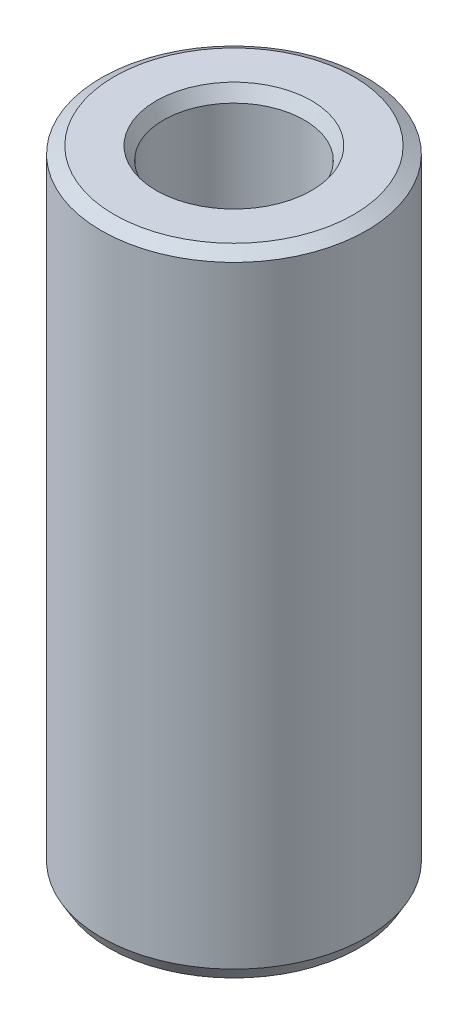
ISO-10303-21;
HEADER;
FILE_DESCRIPTION(('STEP AP214'),'2;1');
FILE_NAME('part.step','',(''),(''),'','','');
FILE_SCHEMA(('AUTOMOTIVE_DESIGN { 1 0 10303 214 1 1 1 1 }'));
ENDSEC;
DATA;
#1=APPLICATION_CONTEXT('core data for automotive mechanical design processes');
#2=APPLICATION_PROTOCOL_DEFINITION('international standard','automotive_design',2000,#1);
#3=PRODUCT_CONTEXT('',#1,'mechanical');
#4=PRODUCT('Part','Part','',(#3));
#5=PRODUCT_RELATED_PRODUCT_CATEGORY('part','',(#4));
#6=PRODUCT_DEFINITION_FORMATION('','',#4);
#7=PRODUCT_DEFINITION_CONTEXT('part definition',#1,'design');
#8=PRODUCT_DEFINITION('design','',#6,#7);
#9=PRODUCT_DEFINITION_SHAPE('','',#8);
#10=(LENGTH_UNIT() NAMED_UNIT(*) SI_UNIT(.MILLI.,.METRE.));
#11=(NAMED_UNIT(*) PLANE_ANGLE_UNIT() SI_UNIT($,.RADIAN.));
#12=(NAMED_UNIT(*) SI_UNIT($,.STERADIAN.) SOLID_ANGLE_UNIT());
#13=UNCERTAINTY_MEASURE_WITH_UNIT(LENGTH_MEASURE(1.E-05),#10,'distance_accuracy_value','');
#14=(GEOMETRIC_REPRESENTATION_CONTEXT(3) GLOBAL_UNCERTAINTY_ASSIGNED_CONTEXT((#13)) GLOBAL_UNIT_ASSIGNED_CONTEXT((#10,
#11,#12)) REPRESENTATION_CONTEXT('',''));
#15=CARTESIAN_POINT('',(0.,0.,0.));
#16=DIRECTION('',(0.,0.,1.));
#17=DIRECTION('',(1.,0.,0.));
#18=AXIS2_PLACEMENT_3D('',#15,#16,#17);
#19=CARTESIAN_POINT('',(0.,167.013474711773,0.));
#20=DIRECTION('',(0.,-1.,0.));
#21=DIRECTION('',(0.,0.,-1.));
#22=AXIS2_PLACEMENT_3D('',#19,#20,#21);
#23=CYLINDRICAL_SURFACE('',#22,35.);
#24=CARTESIAN_POINT('',(0.,3.4060776990138,0.));
#25=DIRECTION('',(0.,1.,0.));
#26=DIRECTION('',(0.,0.,1.));
#27=AXIS2_PLACEMENT_3D('',#24,#25,#26);
#28=CIRCLE('',#27,35.);
#29=CARTESIAN_POINT('',(0.,3.4060776990138,35.));
#30=VERTEX_POINT('',#29);
#31=EDGE_CURVE('E10',#30,#30,#28,.T.);
#32=ORIENTED_EDGE('',*,*,#31,.T.);
#33=EDGE_LOOP('',(#32));
#34=FACE_BOUND('',#33,.T.);
#35=CARTESIAN_POINT('',(0.,165.046974835367,0.));
#36=DIRECTION('',(0.,1.,0.));
#37=DIRECTION('',(0.,0.,1.));
#38=AXIS2_PLACEMENT_3D('',#35,#36,#37);
#39=CIRCLE('',#38,35.);
#40=CARTESIAN_POINT('',(0.,165.046974835367,35.));
#41=VERTEX_POINT('',#40);
#42=EDGE_CURVE('E50',#41,#41,#39,.F.);
#43=ORIENTED_EDGE('',*,*,#42,.T.);
#44=EDGE_LOOP('',(#43));
#45=FACE_BOUND('',#44,.T.);
#46=ADVANCED_FACE('F39',(#34,#45),#23,.T.);
#47=CARTESIAN_POINT('',(0.,167.013474711773,0.));
#48=DIRECTION('',(0.,1.,0.));
#49=DIRECTION('',(0.,0.,1.));
#50=AXIS2_PLACEMENT_3D('',#47,#48,#49);
#51=PLANE('',#50);
#52=CARTESIAN_POINT('',(0.,167.013474711773,0.));
#53=DIRECTION('',(0.,1.,0.));
#54=DIRECTION('',(0.,0.,1.));
#55=AXIS2_PLACEMENT_3D('',#52,#53,#54);
#56=CIRCLE('',#55,20.5304459451835);
#57=CARTESIAN_POINT('',(0.,167.013474711773,20.5304459451835));
#58=VERTEX_POINT('',#57);
#59=EDGE_CURVE('E58',#58,#58,#56,.F.);
#60=ORIENTED_EDGE('',*,*,#59,.T.);
#61=EDGE_LOOP('',(#60));
#62=FACE_BOUND('',#61,.T.);
#63=CARTESIAN_POINT('',(0.,167.013474711773,0.));
#64=DIRECTION('',(0.,1.,0.));
#65=DIRECTION('',(0.,0.,1.));
#66=AXIS2_PLACEMENT_3D('',#63,#64,#65);
#67=CIRCLE('',#66,31.5939223009863);
#68=CARTESIAN_POINT('',(0.,167.013474711773,31.5939223009863));
#69=VERTEX_POINT('',#68);
#70=EDGE_CURVE('E61',#69,#69,#67,.T.);
#71=ORIENTED_EDGE('',*,*,#70,.T.);
#72=EDGE_LOOP('',(#71));
#73=FACE_BOUND('',#72,.T.);
#74=ADVANCED_FACE('F88',(#62,#73),#51,.T.);
#75=CARTESIAN_POINT('',(0.,0.,0.));
#76=DIRECTION('',(0.,1.,0.));
#77=DIRECTION('',(0.,0.,1.));
#78=AXIS2_PLACEMENT_3D('',#75,#76,#77);
#79=PLANE('',#78);
#80=CARTESIAN_POINT('',(0.,0.,0.));
#81=DIRECTION('',(0.,1.,0.));
#82=DIRECTION('',(0.,0.,1.));
#83=AXIS2_PLACEMENT_3D('',#80,#81,#82);
#84=CIRCLE('',#83,21.9700237677909);
#85=CARTESIAN_POINT('',(0.,0.,21.9700237677909));
#86=VERTEX_POINT('',#85);
#87=EDGE_CURVE('E51',#86,#86,#84,.T.);
#88=ORIENTED_EDGE('',*,*,#87,.T.);
#89=EDGE_LOOP('',(#88));
#90=FACE_BOUND('',#89,.T.);
#91=CARTESIAN_POINT('',(0.,0.,0.));
#92=DIRECTION('',(0.,1.,0.));
#93=DIRECTION('',(0.,0.,1.));
#94=AXIS2_PLACEMENT_3D('',#91,#92,#93);
#95=CIRCLE('',#94,33.0335001235936);
#96=CARTESIAN_POINT('',(0.,0.,33.0335001235936));
#97=VERTEX_POINT('',#96);
#98=EDGE_CURVE('E54',#97,#97,#95,.F.);
#99=ORIENTED_EDGE('',*,*,#98,.T.);
#100=EDGE_LOOP('',(#99));
#101=FACE_BOUND('',#100,.T.);
#102=ADVANCED_FACE('F83',(#90,#101),#79,.F.);
#103=CARTESIAN_POINT('',(0.,167.013474711773,0.));
#104=DIRECTION('',(0.,-1.,0.));
#105=DIRECTION('',(0.,0.,-1.));
#106=AXIS2_PLACEMENT_3D('',#103,#104,#105);
#107=CYLINDRICAL_SURFACE('',#106,18.5639460687771);
#108=CARTESIAN_POINT('',(0.,163.607397012759,0.));
#109=DIRECTION('',(0.,1.,0.));
#110=DIRECTION('',(0.,0.,1.));
#111=AXIS2_PLACEMENT_3D('',#108,#109,#110);
#112=CIRCLE('',#111,18.5639460687771);
#113=CARTESIAN_POINT('',(0.,163.607397012759,18.5639460687771));
#114=VERTEX_POINT('',#113);
#115=EDGE_CURVE('E67',#114,#114,#112,.T.);
#116=ORIENTED_EDGE('',*,*,#115,.T.);
#117=EDGE_LOOP('',(#116));
#118=FACE_BOUND('',#117,.T.);
#119=CARTESIAN_POINT('',(0.,1.96649987640637,0.));
#120=DIRECTION('',(0.,1.,0.));
#121=DIRECTION('',(0.,0.,1.));
#122=AXIS2_PLACEMENT_3D('',#119,#120,#121);
#123=CIRCLE('',#122,18.5639460687771);
#124=CARTESIAN_POINT('',(0.,1.96649987640637,18.5639460687771));
#125=VERTEX_POINT('',#124);
#126=EDGE_CURVE('E69',#125,#125,#123,.F.);
#127=ORIENTED_EDGE('',*,*,#126,.T.);
#128=EDGE_LOOP('',(#127));
#129=FACE_BOUND('',#128,.T.);
#130=ADVANCED_FACE('F71',(#118,#129),#107,.F.);
#131=CARTESIAN_POINT('',(0.,163.607397012759,0.));
#132=DIRECTION('',(0.,1.,0.));
#133=DIRECTION('',(0.,0.,1.));
#134=AXIS2_PLACEMENT_3D('',#131,#132,#133);
#135=CONICAL_SURFACE('',#134,18.5639460687771,0.5235987755983);
#136=ORIENTED_EDGE('',*,*,#59,.F.);
#137=EDGE_LOOP('',(#136));
#138=FACE_BOUND('',#137,.T.);
#139=ORIENTED_EDGE('',*,*,#115,.F.);
#140=EDGE_LOOP('',(#139));
#141=FACE_BOUND('',#140,.T.);
#142=ADVANCED_FACE('F77',(#138,#141),#135,.F.);
#143=CARTESIAN_POINT('',(0.,0.,0.));
#144=DIRECTION('',(0.,-1.,0.));
#145=DIRECTION('',(0.,0.,-1.));
#146=AXIS2_PLACEMENT_3D('',#143,#144,#145);
#147=CONICAL_SURFACE('',#146,21.9700237677909,1.04719755119659);
#148=ORIENTED_EDGE('',*,*,#126,.F.);
#149=EDGE_LOOP('',(#148));
#150=FACE_BOUND('',#149,.T.);
#151=ORIENTED_EDGE('',*,*,#87,.F.);
#152=EDGE_LOOP('',(#151));
#153=FACE_BOUND('',#152,.T.);
#154=ADVANCED_FACE('F73',(#150,#153),#147,.F.);
#155=CARTESIAN_POINT('',(0.,3.4060776990138,0.));
#156=DIRECTION('',(0.,1.,0.));
#157=DIRECTION('',(0.,0.,1.));
#158=AXIS2_PLACEMENT_3D('',#155,#156,#157);
#159=CONICAL_SURFACE('',#158,35.,0.523598775598301);
#160=CARTESIAN_POINT('',(0.,0.,33.0335001235936));
#161=CARTESIAN_POINT('',(0.,0.0354799760313933,33.0539844973062));
#162=CARTESIAN_POINT('',(0.,0.070959952062787,33.0744688710187));
#163=CARTESIAN_POINT('',(0.,0.141919904125575,33.1154376184439));
#164=CARTESIAN_POINT('',(0.,0.177399880156968,33.1359219921564));
#165=CARTESIAN_POINT('',(0.,0.248359832219756,33.1768907395816));
#166=CARTESIAN_POINT('',(0.,0.283839808251149,33.1973751132941));
#167=CARTESIAN_POINT('',(0.,0.354799760313937,33.2383438607193));
#168=CARTESIAN_POINT('',(0.,0.390279736345331,33.2588282344318));
#169=CARTESIAN_POINT('',(0.,0.461239688408118,33.299796981857));
#170=CARTESIAN_POINT('',(0.,0.496719664439512,33.3202813555695));
#171=CARTESIAN_POINT('',(0.,0.567679616502299,33.3612501029947));
#172=CARTESIAN_POINT('',(0.,0.603159592533693,33.3817344767072));
#173=CARTESIAN_POINT('',(0.,0.674119544596481,33.4227032241324));
#174=CARTESIAN_POINT('',(0.,0.709599520627874,33.4431875978449));
#175=CARTESIAN_POINT('',(0.,0.780559472690662,33.4841563452701));
#176=CARTESIAN_POINT('',(0.,0.816039448722055,33.5046407189826));
#177=CARTESIAN_POINT('',(0.,0.886999400784843,33.5456094664078));
#178=CARTESIAN_POINT('',(0.,0.922479376816237,33.5660938401203));
#179=CARTESIAN_POINT('',(0.,0.993439328879024,33.6070625875455));
#180=CARTESIAN_POINT('',(0.,1.02891930491042,33.627546961258));
#181=CARTESIAN_POINT('',(0.,1.09987925697321,33.6685157086832));
#182=CARTESIAN_POINT('',(0.,1.1353592330046,33.6890000823957));
#183=CARTESIAN_POINT('',(0.,1.20631918506739,33.7299688298209));
#184=CARTESIAN_POINT('',(0.,1.24179916109878,33.7504532035334));
#185=CARTESIAN_POINT('',(0.,1.31275911316157,33.7914219509586));
#186=CARTESIAN_POINT('',(0.,1.34823908919296,33.8119063246711));
#187=CARTESIAN_POINT('',(0.,1.41919904125575,33.8528750720963));
#188=CARTESIAN_POINT('',(0.,1.45467901728714,33.8733594458088));
#189=CARTESIAN_POINT('',(0.,1.52563896934993,33.914328193234));
#190=CARTESIAN_POINT('',(0.,1.56111894538132,33.9348125669465));
#191=CARTESIAN_POINT('',(0.,1.63207889744411,33.9757813143717));
#192=CARTESIAN_POINT('',(0.,1.66755887347551,33.9962656880842));
#193=CARTESIAN_POINT('',(0.,1.73851882553829,34.0372344355094));
#194=CARTESIAN_POINT('',(0.,1.77399880156969,34.0577188092219));
#195=CARTESIAN_POINT('',(0.,1.84495875363247,34.0986875566471));
#196=CARTESIAN_POINT('',(0.,1.88043872966387,34.1191719303596));
#197=CARTESIAN_POINT('',(0.,1.95139868172665,34.1601406777848));
#198=CARTESIAN_POINT('',(0.,1.98687865775805,34.1806250514973));
#199=CARTESIAN_POINT('',(0.,2.05783860982084,34.2215937989225));
#200=CARTESIAN_POINT('',(0.,2.09331858585223,34.242078172635));
#201=CARTESIAN_POINT('',(0.,2.16427853791502,34.2830469200602));
#202=CARTESIAN_POINT('',(0.,2.19975851394641,34.3035312937727));
#203=CARTESIAN_POINT('',(0.,2.2707184660092,34.3445000411979));
#204=CARTESIAN_POINT('',(0.,2.30619844204059,34.3649844149104));
#205=CARTESIAN_POINT('',(0.,2.37715839410338,34.4059531623356));
#206=CARTESIAN_POINT('',(0.,2.41263837013477,34.4264375360481));
#207=CARTESIAN_POINT('',(0.,2.48359832219756,34.4674062834733));
#208=CARTESIAN_POINT('',(0.,2.51907829822896,34.4878906571858));
#209=CARTESIAN_POINT('',(0.,2.59003825029174,34.528859404611));
#210=CARTESIAN_POINT('',(0.,2.62551822632314,34.5493437783235));
#211=CARTESIAN_POINT('',(0.,2.69647817838592,34.5903125257487));
#212=CARTESIAN_POINT('',(0.,2.73195815441732,34.6107968994612));
#213=CARTESIAN_POINT('',(0.,2.80291810648011,34.6517656468864));
#214=CARTESIAN_POINT('',(0.,2.8383980825115,34.6722500205989));
#215=CARTESIAN_POINT('',(0.,2.90935803457429,34.7132187680241));
#216=CARTESIAN_POINT('',(0.,2.94483801060568,34.7337031417366));
#217=CARTESIAN_POINT('',(0.,3.01579796266847,34.7746718891618));
#218=CARTESIAN_POINT('',(0.,3.05127793869986,34.7951562628743));
#219=CARTESIAN_POINT('',(0.,3.12223789076265,34.8361250102995));
#220=CARTESIAN_POINT('',(0.,3.15771786679404,34.856609384012));
#221=CARTESIAN_POINT('',(0.,3.22867781885683,34.8975781314372));
#222=CARTESIAN_POINT('',(0.,3.26415779488822,34.9180625051497));
#223=CARTESIAN_POINT('',(0.,3.33511774695101,34.9590312525749));
#224=CARTESIAN_POINT('',(0.,3.3705977229824,34.9795156262874));
#225=CARTESIAN_POINT('',(0.,3.4060776990138,35.));
#226=B_SPLINE_CURVE_WITH_KNOTS('',3,(#160,#161,#162,#163,#164,#165,#166,#167,#168,#169,#170,
#171,#172,#173,#174,#175,#176,#177,#178,#179,#180,#181,#182,#183,#184,#185,#186,#187,#188,#189,
#190,#191,#192,#193,#194,#195,#196,#197,#198,#199,#200,#201,#202,#203,#204,#205,#206,#207,#208,
#209,#210,#211,#212,#213,#214,#215,#216,#217,#218,#219,#220,#221,#222,#223,#224,#225),
.UNSPECIFIED.,.F.,.F.,(4,2,2,2,2,2,2,2,2,2,2,2,2,2,2,2,2,2,2,2,2,2,2,2,2,2,2,2,2,2,2,2,4),(0.,
0.1229062422754,0.2458124845508,0.3687187268262,0.4916249691016,0.614531211377,0.7374374536524,
0.860343695927799,0.983249938203199,1.1061561804786,1.229062422754,1.3519686650294,
1.4748749073048,1.5977811495802,1.7206873918556,1.843593634131,1.9664998764064,2.0894061186818,
2.2123123609572,2.3352186032326,2.458124845508,2.5810310877834,2.7039373300588,2.8268435723342,
2.9497498146096,3.072656056885,3.1955622991604,3.3184685414358,3.4413747837112,3.5642810259866,
3.687187268262,3.8100935105374,3.9329997528128),.UNSPECIFIED.);
#227=EDGE_CURVE('BSEAM76',#97,#30,#226,.T.);
#228=ORIENTED_EDGE('',*,*,#98,.F.);
#229=ORIENTED_EDGE('',*,*,#31,.F.);
#230=ORIENTED_EDGE('',*,*,#227,.T.);
#231=ORIENTED_EDGE('',*,*,#227,.F.);
#232=EDGE_LOOP('',(#228,#230,#229,#231));
#233=FACE_BOUND('',#232,.T.);
#234=ADVANCED_FACE('F76',(#233),#159,.T.);
#235=CARTESIAN_POINT('',(0.,167.013474711773,0.));
#236=DIRECTION('',(0.,-1.,0.));
#237=DIRECTION('',(0.,0.,-1.));
#238=AXIS2_PLACEMENT_3D('',#235,#236,#237);
#239=CONICAL_SURFACE('',#238,31.5939223009863,1.04719755119659);
#240=ORIENTED_EDGE('',*,*,#42,.F.);
#241=EDGE_LOOP('',(#240));
#242=FACE_BOUND('',#241,.T.);
#243=ORIENTED_EDGE('',*,*,#70,.F.);
#244=EDGE_LOOP('',(#243));
#245=FACE_BOUND('',#244,.T.);
#246=ADVANCED_FACE('F45',(#242,#245),#239,.T.);
#247=CLOSED_SHELL('',(#46,#74,#102,#130,#142,#154,#234,#246));
#248=MANIFOLD_SOLID_BREP('B2',#247);
#249=ADVANCED_BREP_SHAPE_REPRESENTATION('',(#18,#248),#14);
#250=SHAPE_DEFINITION_REPRESENTATION(#9,#249);
ENDSEC;
END-ISO-10303-21;
